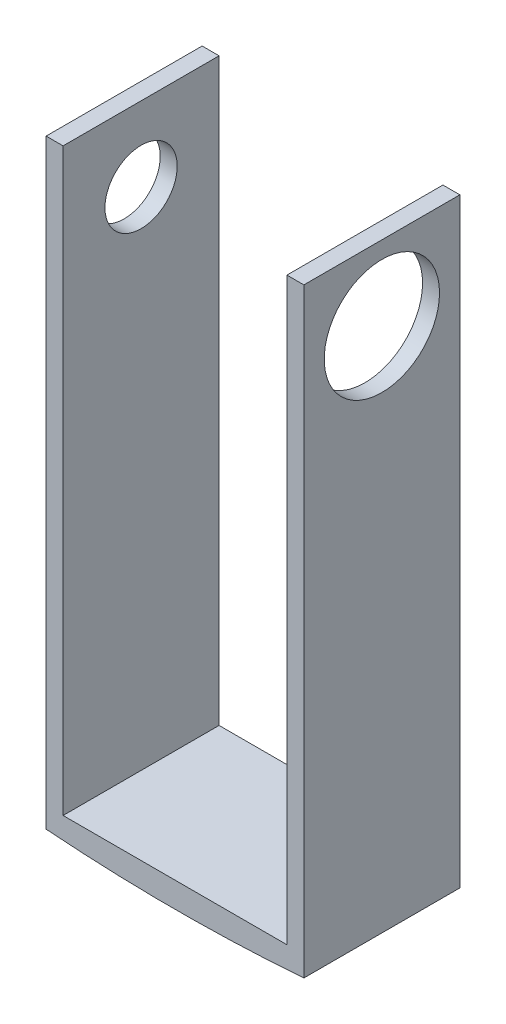
ISO-10303-21;
HEADER;
FILE_DESCRIPTION(('STEP AP214'),'2;1');
FILE_NAME('part.step','',(''),(''),'','','');
FILE_SCHEMA(('AUTOMOTIVE_DESIGN { 1 0 10303 214 1 1 1 1 }'));
ENDSEC;
DATA;
#1=APPLICATION_CONTEXT('core data for automotive mechanical design processes');
#2=APPLICATION_PROTOCOL_DEFINITION('international standard','automotive_design',2000,#1);
#3=PRODUCT_CONTEXT('',#1,'mechanical');
#4=PRODUCT('Part','Part','',(#3));
#5=PRODUCT_RELATED_PRODUCT_CATEGORY('part','',(#4));
#6=PRODUCT_DEFINITION_FORMATION('','',#4);
#7=PRODUCT_DEFINITION_CONTEXT('part definition',#1,'design');
#8=PRODUCT_DEFINITION('design','',#6,#7);
#9=PRODUCT_DEFINITION_SHAPE('','',#8);
#10=(LENGTH_UNIT() NAMED_UNIT(*) SI_UNIT(.MILLI.,.METRE.));
#11=(NAMED_UNIT(*) PLANE_ANGLE_UNIT() SI_UNIT($,.RADIAN.));
#12=(NAMED_UNIT(*) SI_UNIT($,.STERADIAN.) SOLID_ANGLE_UNIT());
#13=UNCERTAINTY_MEASURE_WITH_UNIT(LENGTH_MEASURE(1.E-05),#10,'distance_accuracy_value','');
#14=(GEOMETRIC_REPRESENTATION_CONTEXT(3) GLOBAL_UNCERTAINTY_ASSIGNED_CONTEXT((#13)) GLOBAL_UNIT_ASSIGNED_CONTEXT((#10,
#11,#12)) REPRESENTATION_CONTEXT('',''));
#15=CARTESIAN_POINT('',(0.,0.,0.));
#16=DIRECTION('',(0.,0.,1.));
#17=DIRECTION('',(1.,0.,0.));
#18=AXIS2_PLACEMENT_3D('',#15,#16,#17);
#19=CARTESIAN_POINT('',(-2.71887323943662,20.1871866197183,5.842));
#20=DIRECTION('',(0.,-1.,0.));
#21=DIRECTION('',(0.,0.,-1.));
#22=AXIS2_PLACEMENT_3D('',#19,#20,#21);
#23=PLANE('',#22);
#24=DIRECTION('',(-1.,0.,0.));
#25=VECTOR('',#24,1.);
#26=CARTESIAN_POINT('',(-2.71887323943662,20.1871866197183,0.));
#27=LINE('',#26,#25);
#28=CARTESIAN_POINT('',(-2.71887323943662,20.1871866197183,0.));
#29=VERTEX_POINT('',#28);
#30=CARTESIAN_POINT('',(-3.35387323943662,20.1871866197183,0.));
#31=VERTEX_POINT('',#30);
#32=EDGE_CURVE('E128',#29,#31,#27,.T.);
#33=ORIENTED_EDGE('',*,*,#32,.T.);
#34=DIRECTION('',(0.,0.,-1.));
#35=VECTOR('',#34,1.);
#36=CARTESIAN_POINT('',(-3.35387323943662,20.1871866197183,5.842));
#37=LINE('',#36,#35);
#38=CARTESIAN_POINT('',(-3.35387323943662,20.1871866197183,5.842));
#39=VERTEX_POINT('',#38);
#40=EDGE_CURVE('E11',#39,#31,#37,.T.);
#41=ORIENTED_EDGE('',*,*,#40,.F.);
#42=DIRECTION('',(-1.,0.,0.));
#43=VECTOR('',#42,1.);
#44=CARTESIAN_POINT('',(-2.71887323943662,20.1871866197183,5.842));
#45=LINE('',#44,#43);
#46=CARTESIAN_POINT('',(-2.71887323943662,20.1871866197183,5.842));
#47=VERTEX_POINT('',#46);
#48=EDGE_CURVE('E141',#47,#39,#45,.T.);
#49=ORIENTED_EDGE('',*,*,#48,.F.);
#50=DIRECTION('',(0.,0.,-1.));
#51=VECTOR('',#50,1.);
#52=CARTESIAN_POINT('',(-2.71887323943662,20.1871866197183,5.842));
#53=LINE('',#52,#51);
#54=EDGE_CURVE('E124',#47,#29,#53,.T.);
#55=ORIENTED_EDGE('',*,*,#54,.T.);
#56=EDGE_LOOP('',(#33,#41,#49,#55));
#57=FACE_BOUND('',#56,.T.);
#58=ADVANCED_FACE('F33',(#57),#23,.F.);
#59=CARTESIAN_POINT('',(-3.35387323943662,20.1871866197183,5.842));
#60=DIRECTION('',(1.,0.,0.));
#61=DIRECTION('',(0.,1.,0.));
#62=AXIS2_PLACEMENT_3D('',#59,#60,#61);
#63=PLANE('',#62);
#64=CARTESIAN_POINT('',(-3.35387323943662,17.3931866197183,2.921));
#65=DIRECTION('',(-1.,0.,0.));
#66=DIRECTION('',(0.,0.,1.));
#67=AXIS2_PLACEMENT_3D('',#64,#65,#66);
#68=CIRCLE('',#67,1.35254999999999);
#69=CARTESIAN_POINT('',(-3.35387323943662,17.3931866197183,4.27354999999999));
#70=VERTEX_POINT('',#69);
#71=EDGE_CURVE('E174',#70,#70,#68,.T.);
#72=ORIENTED_EDGE('',*,*,#71,.F.);
#73=EDGE_LOOP('',(#72));
#74=FACE_BOUND('',#73,.T.);
#75=DIRECTION('',(0.,-1.,0.));
#76=VECTOR('',#75,1.);
#77=CARTESIAN_POINT('',(-3.35387323943662,20.1871866197183,0.));
#78=LINE('',#77,#76);
#79=CARTESIAN_POINT('',(-3.35387323943662,-2.29181338028169,0.));
#80=VERTEX_POINT('',#79);
#81=EDGE_CURVE('E131',#31,#80,#78,.T.);
#82=ORIENTED_EDGE('',*,*,#81,.T.);
#83=DIRECTION('',(0.,0.,-1.));
#84=VECTOR('',#83,1.);
#85=CARTESIAN_POINT('',(-3.35387323943662,-2.29181338028169,5.842));
#86=LINE('',#85,#84);
#87=CARTESIAN_POINT('',(-3.35387323943662,-2.29181338028169,5.842));
#88=VERTEX_POINT('',#87);
#89=EDGE_CURVE('E41',#88,#80,#86,.T.);
#90=ORIENTED_EDGE('',*,*,#89,.F.);
#91=DIRECTION('',(0.,-1.,0.));
#92=VECTOR('',#91,1.);
#93=CARTESIAN_POINT('',(-3.35387323943662,20.1871866197183,5.842));
#94=LINE('',#93,#92);
#95=EDGE_CURVE('E90',#39,#88,#94,.T.);
#96=ORIENTED_EDGE('',*,*,#95,.F.);
#97=ORIENTED_EDGE('',*,*,#40,.T.);
#98=EDGE_LOOP('',(#82,#90,#96,#97));
#99=FACE_BOUND('',#98,.T.);
#100=ADVANCED_FACE('F202',(#74,#99),#63,.F.);
#101=CARTESIAN_POINT('',(6.29812676056338,-2.29181338028169,5.842));
#102=DIRECTION('',(-1.,0.,0.));
#103=DIRECTION('',(0.,-1.,0.));
#104=AXIS2_PLACEMENT_3D('',#101,#102,#103);
#105=PLANE('',#104);
#106=CARTESIAN_POINT('',(6.29812676056338,17.3931866197183,2.921));
#107=DIRECTION('',(1.,0.,0.));
#108=DIRECTION('',(0.,0.,-1.));
#109=AXIS2_PLACEMENT_3D('',#106,#107,#108);
#110=CIRCLE('',#109,2.159);
#111=CARTESIAN_POINT('',(6.29812676056338,17.3931866197183,0.762000000000001));
#112=VERTEX_POINT('',#111);
#113=EDGE_CURVE('E171',#112,#112,#110,.T.);
#114=ORIENTED_EDGE('',*,*,#113,.F.);
#115=EDGE_LOOP('',(#114));
#116=FACE_BOUND('',#115,.T.);
#117=DIRECTION('',(0.,1.,0.));
#118=VECTOR('',#117,1.);
#119=CARTESIAN_POINT('',(6.29812676056338,-2.29181338028169,0.));
#120=LINE('',#119,#118);
#121=CARTESIAN_POINT('',(6.29812676056333,-2.29181338028169,0.));
#122=VERTEX_POINT('',#121);
#123=CARTESIAN_POINT('',(6.29812676056338,20.1871866197183,0.));
#124=VERTEX_POINT('',#123);
#125=EDGE_CURVE('E134',#122,#124,#120,.T.);
#126=ORIENTED_EDGE('',*,*,#125,.T.);
#127=DIRECTION('',(0.,0.,-1.));
#128=VECTOR('',#127,1.);
#129=CARTESIAN_POINT('',(6.29812676056338,20.1871866197183,5.842));
#130=LINE('',#129,#128);
#131=CARTESIAN_POINT('',(6.29812676056338,20.1871866197183,5.842));
#132=VERTEX_POINT('',#131);
#133=EDGE_CURVE('E145',#132,#124,#130,.T.);
#134=ORIENTED_EDGE('',*,*,#133,.F.);
#135=DIRECTION('',(0.,1.,0.));
#136=VECTOR('',#135,1.);
#137=CARTESIAN_POINT('',(6.29812676056338,-2.29181338028169,5.842));
#138=LINE('',#137,#136);
#139=CARTESIAN_POINT('',(6.29812676056338,-2.29181338028169,5.842));
#140=VERTEX_POINT('',#139);
#141=EDGE_CURVE('E181',#140,#132,#138,.T.);
#142=ORIENTED_EDGE('',*,*,#141,.F.);
#143=DIRECTION('',(0.,0.,-1.));
#144=VECTOR('',#143,1.);
#145=CARTESIAN_POINT('',(6.29812676056338,-2.29181338028169,5.842));
#146=LINE('',#145,#144);
#147=EDGE_CURVE('E148',#140,#122,#146,.T.);
#148=ORIENTED_EDGE('',*,*,#147,.T.);
#149=EDGE_LOOP('',(#126,#134,#142,#148));
#150=FACE_BOUND('',#149,.T.);
#151=ADVANCED_FACE('F184',(#116,#150),#105,.F.);
#152=CARTESIAN_POINT('',(5.66312676056338,20.1871866197183,5.842));
#153=DIRECTION('',(0.,-1.,0.));
#154=DIRECTION('',(0.,0.,-1.));
#155=AXIS2_PLACEMENT_3D('',#152,#153,#154);
#156=PLANE('',#155);
#157=DIRECTION('',(-1.,0.,0.));
#158=VECTOR('',#157,1.);
#159=CARTESIAN_POINT('',(5.66312676056338,20.1871866197183,0.));
#160=LINE('',#159,#158);
#161=CARTESIAN_POINT('',(5.66312676056338,20.1871866197183,0.));
#162=VERTEX_POINT('',#161);
#163=EDGE_CURVE('E136',#124,#162,#160,.T.);
#164=ORIENTED_EDGE('',*,*,#163,.T.);
#165=DIRECTION('',(0.,0.,-1.));
#166=VECTOR('',#165,1.);
#167=CARTESIAN_POINT('',(5.66312676056338,20.1871866197183,5.842));
#168=LINE('',#167,#166);
#169=CARTESIAN_POINT('',(5.66312676056338,20.1871866197183,5.842));
#170=VERTEX_POINT('',#169);
#171=EDGE_CURVE('E119',#170,#162,#168,.T.);
#172=ORIENTED_EDGE('',*,*,#171,.F.);
#173=DIRECTION('',(-1.,0.,0.));
#174=VECTOR('',#173,1.);
#175=CARTESIAN_POINT('',(5.66312676056338,20.1871866197183,5.842));
#176=LINE('',#175,#174);
#177=EDGE_CURVE('E110',#132,#170,#176,.T.);
#178=ORIENTED_EDGE('',*,*,#177,.F.);
#179=ORIENTED_EDGE('',*,*,#133,.T.);
#180=EDGE_LOOP('',(#164,#172,#178,#179));
#181=FACE_BOUND('',#180,.T.);
#182=ADVANCED_FACE('F186',(#181),#156,.F.);
#183=CARTESIAN_POINT('',(5.66312676056338,20.1871866197183,5.842));
#184=DIRECTION('',(1.,0.,0.));
#185=DIRECTION('',(0.,1.,0.));
#186=AXIS2_PLACEMENT_3D('',#183,#184,#185);
#187=PLANE('',#186);
#188=CARTESIAN_POINT('',(5.66312676056338,17.3931866197183,2.921));
#189=DIRECTION('',(1.,0.,0.));
#190=DIRECTION('',(0.,1.,0.));
#191=AXIS2_PLACEMENT_3D('',#188,#189,#190);
#192=CIRCLE('',#191,2.159);
#193=CARTESIAN_POINT('',(5.66312676056338,19.5521866197183,2.921));
#194=VERTEX_POINT('',#193);
#195=EDGE_CURVE('E166',#194,#194,#192,.F.);
#196=ORIENTED_EDGE('',*,*,#195,.F.);
#197=EDGE_LOOP('',(#196));
#198=FACE_BOUND('',#197,.T.);
#199=DIRECTION('',(0.,-1.,0.));
#200=VECTOR('',#199,1.);
#201=CARTESIAN_POINT('',(5.66312676056338,20.1871866197183,0.));
#202=LINE('',#201,#200);
#203=CARTESIAN_POINT('',(5.66312676056338,-1.52981338028169,0.));
#204=VERTEX_POINT('',#203);
#205=EDGE_CURVE('E118',#162,#204,#202,.T.);
#206=ORIENTED_EDGE('',*,*,#205,.T.);
#207=DIRECTION('',(0.,0.,-1.));
#208=VECTOR('',#207,1.);
#209=CARTESIAN_POINT('',(5.66312676056338,-1.52981338028169,5.842));
#210=LINE('',#209,#208);
#211=CARTESIAN_POINT('',(5.66312676056338,-1.52981338028169,5.842));
#212=VERTEX_POINT('',#211);
#213=EDGE_CURVE('E115',#212,#204,#210,.T.);
#214=ORIENTED_EDGE('',*,*,#213,.F.);
#215=DIRECTION('',(0.,-1.,0.));
#216=VECTOR('',#215,1.);
#217=CARTESIAN_POINT('',(5.66312676056338,20.1871866197183,5.842));
#218=LINE('',#217,#216);
#219=EDGE_CURVE('E104',#170,#212,#218,.T.);
#220=ORIENTED_EDGE('',*,*,#219,.F.);
#221=ORIENTED_EDGE('',*,*,#171,.T.);
#222=EDGE_LOOP('',(#206,#214,#220,#221));
#223=FACE_BOUND('',#222,.T.);
#224=ADVANCED_FACE('F116',(#198,#223),#187,.F.);
#225=CARTESIAN_POINT('',(5.66312676056338,-1.52981338028169,5.842));
#226=DIRECTION('',(0.,-1.,0.));
#227=DIRECTION('',(1.,0.,0.));
#228=AXIS2_PLACEMENT_3D('',#225,#226,#227);
#229=PLANE('',#228);
#230=DIRECTION('',(-1.,0.,0.));
#231=VECTOR('',#230,1.);
#232=CARTESIAN_POINT('',(5.66312676056338,-1.52981338028169,0.));
#233=LINE('',#232,#231);
#234=CARTESIAN_POINT('',(-2.71887323943662,-1.52981338028169,0.));
#235=VERTEX_POINT('',#234);
#236=EDGE_CURVE('E76',#204,#235,#233,.T.);
#237=ORIENTED_EDGE('',*,*,#236,.T.);
#238=DIRECTION('',(0.,0.,-1.));
#239=VECTOR('',#238,1.);
#240=CARTESIAN_POINT('',(-2.71887323943662,-1.52981338028169,5.842));
#241=LINE('',#240,#239);
#242=CARTESIAN_POINT('',(-2.71887323943662,-1.52981338028169,5.842));
#243=VERTEX_POINT('',#242);
#244=EDGE_CURVE('E120',#243,#235,#241,.T.);
#245=ORIENTED_EDGE('',*,*,#244,.F.);
#246=DIRECTION('',(-1.,0.,0.));
#247=VECTOR('',#246,1.);
#248=CARTESIAN_POINT('',(5.66312676056338,-1.52981338028169,5.842));
#249=LINE('',#248,#247);
#250=EDGE_CURVE('E108',#212,#243,#249,.T.);
#251=ORIENTED_EDGE('',*,*,#250,.F.);
#252=ORIENTED_EDGE('',*,*,#213,.T.);
#253=EDGE_LOOP('',(#237,#245,#251,#252));
#254=FACE_BOUND('',#253,.T.);
#255=ADVANCED_FACE('F122',(#254),#229,.F.);
#256=CARTESIAN_POINT('',(-2.71887323943662,-1.52981338028169,5.842));
#257=DIRECTION('',(-1.,0.,0.));
#258=DIRECTION('',(0.,-1.,0.));
#259=AXIS2_PLACEMENT_3D('',#256,#257,#258);
#260=PLANE('',#259);
#261=CARTESIAN_POINT('',(-2.71887323943662,17.3931866197183,2.921));
#262=DIRECTION('',(-1.,0.,0.));
#263=DIRECTION('',(0.,-1.,0.));
#264=AXIS2_PLACEMENT_3D('',#261,#262,#263);
#265=CIRCLE('',#264,1.35254999999999);
#266=CARTESIAN_POINT('',(-2.71887323943662,16.0406366197183,2.921));
#267=VERTEX_POINT('',#266);
#268=EDGE_CURVE('E132',#267,#267,#265,.T.);
#269=ORIENTED_EDGE('',*,*,#268,.T.);
#270=EDGE_LOOP('',(#269));
#271=FACE_BOUND('',#270,.T.);
#272=DIRECTION('',(0.,1.,0.));
#273=VECTOR('',#272,1.);
#274=CARTESIAN_POINT('',(-2.71887323943662,-1.52981338028169,0.));
#275=LINE('',#274,#273);
#276=EDGE_CURVE('E82',#235,#29,#275,.T.);
#277=ORIENTED_EDGE('',*,*,#276,.T.);
#278=ORIENTED_EDGE('',*,*,#54,.F.);
#279=DIRECTION('',(0.,1.,0.));
#280=VECTOR('',#279,1.);
#281=CARTESIAN_POINT('',(-2.71887323943662,-1.52981338028169,5.842));
#282=LINE('',#281,#280);
#283=EDGE_CURVE('E49',#243,#47,#282,.T.);
#284=ORIENTED_EDGE('',*,*,#283,.F.);
#285=ORIENTED_EDGE('',*,*,#244,.T.);
#286=EDGE_LOOP('',(#277,#278,#284,#285));
#287=FACE_BOUND('',#286,.T.);
#288=ADVANCED_FACE('F190',(#271,#287),#260,.F.);
#289=CARTESIAN_POINT('',(0.,0.,5.842));
#290=DIRECTION('',(0.,0.,1.));
#291=DIRECTION('',(1.,0.,0.));
#292=AXIS2_PLACEMENT_3D('',#289,#290,#291);
#293=PLANE('',#292);
#294=ORIENTED_EDGE('',*,*,#48,.T.);
#295=ORIENTED_EDGE('',*,*,#95,.T.);
#296=CARTESIAN_POINT('',(1.47212676056338,60.260295840751,5.842));
#297=DIRECTION('',(0.,0.,1.));
#298=DIRECTION('',(1.,0.,0.));
#299=AXIS2_PLACEMENT_3D('',#296,#297,#298);
#300=CIRCLE('',#299,62.738);
#301=EDGE_CURVE('E159',#88,#140,#300,.T.);
#302=ORIENTED_EDGE('',*,*,#301,.T.);
#303=ORIENTED_EDGE('',*,*,#141,.T.);
#304=ORIENTED_EDGE('',*,*,#177,.T.);
#305=ORIENTED_EDGE('',*,*,#219,.T.);
#306=ORIENTED_EDGE('',*,*,#250,.T.);
#307=ORIENTED_EDGE('',*,*,#283,.T.);
#308=EDGE_LOOP('',(#294,#295,#302,#303,#304,#305,#306,#307));
#309=FACE_BOUND('',#308,.T.);
#310=ADVANCED_FACE('F106',(#309),#293,.T.);
#311=CARTESIAN_POINT('',(0.,0.,0.));
#312=DIRECTION('',(0.,0.,1.));
#313=DIRECTION('',(1.,0.,0.));
#314=AXIS2_PLACEMENT_3D('',#311,#312,#313);
#315=PLANE('',#314);
#316=ORIENTED_EDGE('',*,*,#32,.F.);
#317=ORIENTED_EDGE('',*,*,#276,.F.);
#318=ORIENTED_EDGE('',*,*,#236,.F.);
#319=ORIENTED_EDGE('',*,*,#205,.F.);
#320=ORIENTED_EDGE('',*,*,#163,.F.);
#321=ORIENTED_EDGE('',*,*,#125,.F.);
#322=CARTESIAN_POINT('',(1.47212676056338,60.260295840751,0.));
#323=DIRECTION('',(0.,0.,1.));
#324=DIRECTION('',(1.,0.,0.));
#325=AXIS2_PLACEMENT_3D('',#322,#323,#324);
#326=CIRCLE('',#325,62.738);
#327=EDGE_CURVE('E157',#80,#122,#326,.T.);
#328=ORIENTED_EDGE('',*,*,#327,.F.);
#329=ORIENTED_EDGE('',*,*,#81,.F.);
#330=EDGE_LOOP('',(#316,#317,#318,#319,#320,#321,#328,#329));
#331=FACE_BOUND('',#330,.T.);
#332=ADVANCED_FACE('F163',(#331),#315,.F.);
#333=CARTESIAN_POINT('',(-3.35387323943662,17.3931866197183,2.921));
#334=DIRECTION('',(-1.,0.,0.));
#335=DIRECTION('',(0.,0.,1.));
#336=AXIS2_PLACEMENT_3D('',#333,#334,#335);
#337=CYLINDRICAL_SURFACE('',#336,1.35254999999999);
#338=ORIENTED_EDGE('',*,*,#268,.F.);
#339=EDGE_LOOP('',(#338));
#340=FACE_BOUND('',#339,.T.);
#341=ORIENTED_EDGE('',*,*,#71,.T.);
#342=EDGE_LOOP('',(#341));
#343=FACE_BOUND('',#342,.T.);
#344=ADVANCED_FACE('F224',(#340,#343),#337,.F.);
#345=CARTESIAN_POINT('',(-3.35487323943662,17.3931866197183,2.921));
#346=DIRECTION('',(1.,0.,0.));
#347=DIRECTION('',(0.,0.,-1.));
#348=AXIS2_PLACEMENT_3D('',#345,#346,#347);
#349=CYLINDRICAL_SURFACE('',#348,2.159);
#350=ORIENTED_EDGE('',*,*,#113,.T.);
#351=EDGE_LOOP('',(#350));
#352=FACE_BOUND('',#351,.T.);
#353=ORIENTED_EDGE('',*,*,#195,.T.);
#354=EDGE_LOOP('',(#353));
#355=FACE_BOUND('',#354,.T.);
#356=ADVANCED_FACE('F222',(#352,#355),#349,.F.);
#357=CARTESIAN_POINT('',(1.47212676056338,60.260295840751,5.842));
#358=DIRECTION('',(0.,0.,-1.));
#359=DIRECTION('',(-1.,0.,0.));
#360=AXIS2_PLACEMENT_3D('',#357,#358,#359);
#361=CYLINDRICAL_SURFACE('',#360,62.738);
#362=ORIENTED_EDGE('',*,*,#327,.T.);
#363=ORIENTED_EDGE('',*,*,#147,.F.);
#364=ORIENTED_EDGE('',*,*,#301,.F.);
#365=ORIENTED_EDGE('',*,*,#89,.T.);
#366=EDGE_LOOP('',(#362,#363,#364,#365));
#367=FACE_BOUND('',#366,.T.);
#368=ADVANCED_FACE('F155',(#367),#361,.T.);
#369=CLOSED_SHELL('',(#58,#100,#151,#182,#224,#255,#288,#310,#332,#344,#356,#368));
#370=MANIFOLD_SOLID_BREP('B2',#369);
#371=ADVANCED_BREP_SHAPE_REPRESENTATION('',(#18,#370),#14);
#372=SHAPE_DEFINITION_REPRESENTATION(#9,#371);
ENDSEC;
END-ISO-10303-21;
